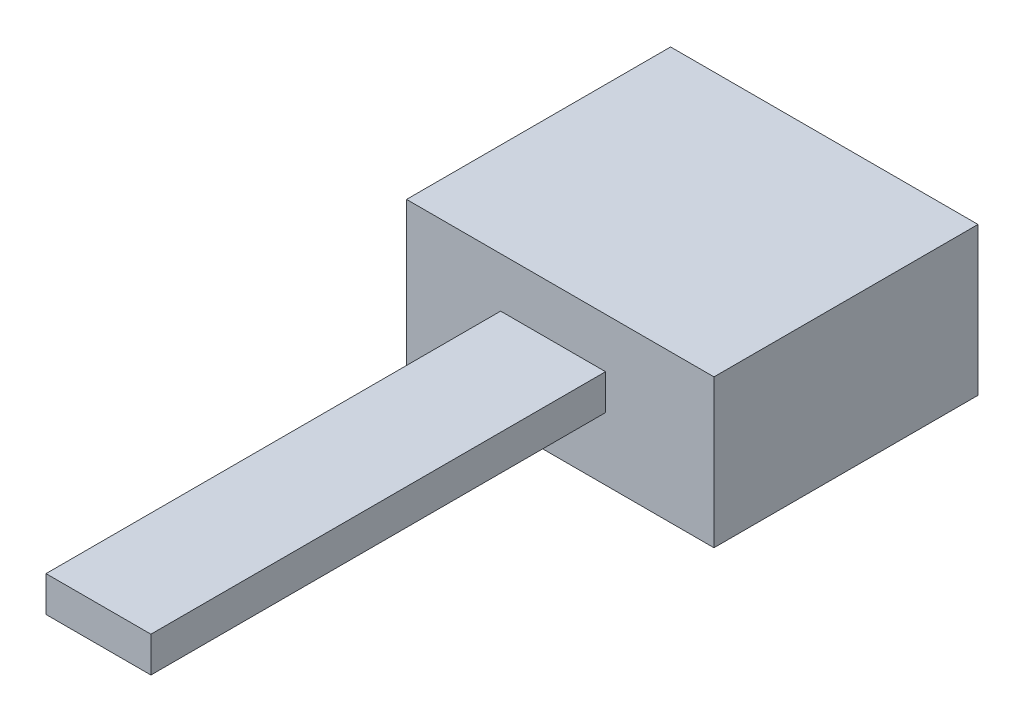
ISO-10303-21;
HEADER;
FILE_DESCRIPTION(('STEP AP214'),'2;1');
FILE_NAME('part.step','',(''),(''),'','','');
FILE_SCHEMA(('AUTOMOTIVE_DESIGN { 1 0 10303 214 1 1 1 1 }'));
ENDSEC;
DATA;
#1=APPLICATION_CONTEXT('core data for automotive mechanical design processes');
#2=APPLICATION_PROTOCOL_DEFINITION('international standard','automotive_design',2000,#1);
#3=PRODUCT_CONTEXT('',#1,'mechanical');
#4=PRODUCT('Part','Part','',(#3));
#5=PRODUCT_RELATED_PRODUCT_CATEGORY('part','',(#4));
#6=PRODUCT_DEFINITION_FORMATION('','',#4);
#7=PRODUCT_DEFINITION_CONTEXT('part definition',#1,'design');
#8=PRODUCT_DEFINITION('design','',#6,#7);
#9=PRODUCT_DEFINITION_SHAPE('','',#8);
#10=(LENGTH_UNIT() NAMED_UNIT(*) SI_UNIT(.MILLI.,.METRE.));
#11=(NAMED_UNIT(*) PLANE_ANGLE_UNIT() SI_UNIT($,.RADIAN.));
#12=(NAMED_UNIT(*) SI_UNIT($,.STERADIAN.) SOLID_ANGLE_UNIT());
#13=UNCERTAINTY_MEASURE_WITH_UNIT(LENGTH_MEASURE(1.E-05),#10,'distance_accuracy_value','');
#14=(GEOMETRIC_REPRESENTATION_CONTEXT(3) GLOBAL_UNCERTAINTY_ASSIGNED_CONTEXT((#13)) GLOBAL_UNIT_ASSIGNED_CONTEXT((#10,
#11,#12)) REPRESENTATION_CONTEXT('',''));
#15=CARTESIAN_POINT('',(0.,0.,0.));
#16=DIRECTION('',(0.,0.,1.));
#17=DIRECTION('',(1.,0.,0.));
#18=AXIS2_PLACEMENT_3D('',#15,#16,#17);
#19=CARTESIAN_POINT('',(0.,21.5,0.));
#20=DIRECTION('',(0.,0.,-1.));
#21=DIRECTION('',(-1.,0.,0.));
#22=AXIS2_PLACEMENT_3D('',#19,#20,#21);
#23=PLANE('',#22);
#24=DIRECTION('',(1.,0.,0.));
#25=VECTOR('',#24,1.);
#26=CARTESIAN_POINT('',(0.,0.,0.));
#27=LINE('',#26,#25);
#28=CARTESIAN_POINT('',(0.,0.,0.));
#29=VERTEX_POINT('',#28);
#30=CARTESIAN_POINT('',(44.6532,0.,0.));
#31=VERTEX_POINT('',#30);
#32=EDGE_CURVE('E133',#29,#31,#27,.T.);
#33=ORIENTED_EDGE('',*,*,#32,.T.);
#34=DIRECTION('',(0.,-1.,0.));
#35=VECTOR('',#34,1.);
#36=CARTESIAN_POINT('',(44.6532,21.5,0.));
#37=LINE('',#36,#35);
#38=CARTESIAN_POINT('',(44.6532,21.5,0.));
#39=VERTEX_POINT('',#38);
#40=EDGE_CURVE('E48',#39,#31,#37,.T.);
#41=ORIENTED_EDGE('',*,*,#40,.F.);
#42=DIRECTION('',(1.,0.,0.));
#43=VECTOR('',#42,1.);
#44=CARTESIAN_POINT('',(0.,21.5,0.));
#45=LINE('',#44,#43);
#46=CARTESIAN_POINT('',(0.,21.5,0.));
#47=VERTEX_POINT('',#46);
#48=EDGE_CURVE('E143',#47,#39,#45,.T.);
#49=ORIENTED_EDGE('',*,*,#48,.F.);
#50=DIRECTION('',(0.,-1.,0.));
#51=VECTOR('',#50,1.);
#52=CARTESIAN_POINT('',(0.,21.5,0.));
#53=LINE('',#52,#51);
#54=EDGE_CURVE('E11',#47,#29,#53,.T.);
#55=ORIENTED_EDGE('',*,*,#54,.T.);
#56=EDGE_LOOP('',(#33,#41,#49,#55));
#57=FACE_BOUND('',#56,.T.);
#58=DIRECTION('',(0.,-1.,0.));
#59=VECTOR('',#58,1.);
#60=CARTESIAN_POINT('',(13.6673265662921,14.2781488346486,0.));
#61=LINE('',#60,#59);
#62=CARTESIAN_POINT('',(13.6673265662921,14.2781488346486,0.));
#63=VERTEX_POINT('',#62);
#64=CARTESIAN_POINT('',(13.6673265662921,9.13606666989608,0.));
#65=VERTEX_POINT('',#64);
#66=EDGE_CURVE('E55',#63,#65,#61,.T.);
#67=ORIENTED_EDGE('',*,*,#66,.F.);
#68=DIRECTION('',(-1.,0.,0.));
#69=VECTOR('',#68,1.);
#70=CARTESIAN_POINT('',(13.6673265662921,14.2781488346486,0.));
#71=LINE('',#70,#69);
#72=CARTESIAN_POINT('',(28.9073265662921,14.2781488346486,0.));
#73=VERTEX_POINT('',#72);
#74=EDGE_CURVE('E59',#73,#63,#71,.T.);
#75=ORIENTED_EDGE('',*,*,#74,.F.);
#76=DIRECTION('',(0.,1.,0.));
#77=VECTOR('',#76,1.);
#78=CARTESIAN_POINT('',(28.9073265662921,14.2781488346486,0.));
#79=LINE('',#78,#77);
#80=CARTESIAN_POINT('',(28.9073265662921,9.13606666989608,0.));
#81=VERTEX_POINT('',#80);
#82=EDGE_CURVE('E283',#81,#73,#79,.T.);
#83=ORIENTED_EDGE('',*,*,#82,.F.);
#84=DIRECTION('',(1.,0.,0.));
#85=VECTOR('',#84,1.);
#86=CARTESIAN_POINT('',(13.6673265662921,9.13606666989608,0.));
#87=LINE('',#86,#85);
#88=EDGE_CURVE('E293',#65,#81,#87,.T.);
#89=ORIENTED_EDGE('',*,*,#88,.F.);
#90=EDGE_LOOP('',(#67,#75,#83,#89));
#91=FACE_BOUND('',#90,.T.);
#92=ADVANCED_FACE('F39',(#57,#91),#23,.F.);
#93=CARTESIAN_POINT('',(0.,21.5,0.));
#94=DIRECTION('',(1.,0.,0.));
#95=DIRECTION('',(0.,0.,-1.));
#96=AXIS2_PLACEMENT_3D('',#93,#94,#95);
#97=PLANE('',#96);
#98=DIRECTION('',(0.,0.,1.));
#99=VECTOR('',#98,1.);
#100=CARTESIAN_POINT('',(0.,0.,0.));
#101=LINE('',#100,#99);
#102=CARTESIAN_POINT('',(0.,0.,-38.354));
#103=VERTEX_POINT('',#102);
#104=EDGE_CURVE('E128',#103,#29,#101,.T.);
#105=ORIENTED_EDGE('',*,*,#104,.T.);
#106=ORIENTED_EDGE('',*,*,#54,.F.);
#107=DIRECTION('',(0.,0.,1.));
#108=VECTOR('',#107,1.);
#109=CARTESIAN_POINT('',(0.,21.5,0.));
#110=LINE('',#109,#108);
#111=CARTESIAN_POINT('',(0.,21.5,-38.354));
#112=VERTEX_POINT('',#111);
#113=EDGE_CURVE('E139',#112,#47,#110,.T.);
#114=ORIENTED_EDGE('',*,*,#113,.F.);
#115=DIRECTION('',(0.,-1.,0.));
#116=VECTOR('',#115,1.);
#117=CARTESIAN_POINT('',(0.,21.5,-38.354));
#118=LINE('',#117,#116);
#119=EDGE_CURVE('E152',#112,#103,#118,.T.);
#120=ORIENTED_EDGE('',*,*,#119,.T.);
#121=EDGE_LOOP('',(#105,#106,#114,#120));
#122=FACE_BOUND('',#121,.T.);
#123=ADVANCED_FACE('F41',(#122),#97,.F.);
#124=CARTESIAN_POINT('',(44.6532,21.5,0.));
#125=DIRECTION('',(-1.,0.,0.));
#126=DIRECTION('',(0.,0.,1.));
#127=AXIS2_PLACEMENT_3D('',#124,#125,#126);
#128=PLANE('',#127);
#129=DIRECTION('',(0.,0.,-1.));
#130=VECTOR('',#129,1.);
#131=CARTESIAN_POINT('',(44.6532,0.,0.));
#132=LINE('',#131,#130);
#133=CARTESIAN_POINT('',(44.6532,0.,-38.354));
#134=VERTEX_POINT('',#133);
#135=EDGE_CURVE('E156',#31,#134,#132,.T.);
#136=ORIENTED_EDGE('',*,*,#135,.T.);
#137=DIRECTION('',(0.,-1.,0.));
#138=VECTOR('',#137,1.);
#139=CARTESIAN_POINT('',(44.6532,21.5,-38.354));
#140=LINE('',#139,#138);
#141=CARTESIAN_POINT('',(44.6532,21.5,-38.354));
#142=VERTEX_POINT('',#141);
#143=EDGE_CURVE('E164',#142,#134,#140,.T.);
#144=ORIENTED_EDGE('',*,*,#143,.F.);
#145=DIRECTION('',(0.,0.,-1.));
#146=VECTOR('',#145,1.);
#147=CARTESIAN_POINT('',(44.6532,21.5,0.));
#148=LINE('',#147,#146);
#149=EDGE_CURVE('E147',#39,#142,#148,.T.);
#150=ORIENTED_EDGE('',*,*,#149,.F.);
#151=ORIENTED_EDGE('',*,*,#40,.T.);
#152=EDGE_LOOP('',(#136,#144,#150,#151));
#153=FACE_BOUND('',#152,.T.);
#154=ADVANCED_FACE('F173',(#153),#128,.F.);
#155=CARTESIAN_POINT('',(0.,21.5,-38.354));
#156=DIRECTION('',(0.,0.,1.));
#157=DIRECTION('',(1.,0.,0.));
#158=AXIS2_PLACEMENT_3D('',#155,#156,#157);
#159=PLANE('',#158);
#160=DIRECTION('',(-1.,0.,0.));
#161=VECTOR('',#160,1.);
#162=CARTESIAN_POINT('',(0.,0.,-38.354));
#163=LINE('',#162,#161);
#164=EDGE_CURVE('E144',#134,#103,#163,.T.);
#165=ORIENTED_EDGE('',*,*,#164,.T.);
#166=ORIENTED_EDGE('',*,*,#119,.F.);
#167=DIRECTION('',(-1.,0.,0.));
#168=VECTOR('',#167,1.);
#169=CARTESIAN_POINT('',(0.,21.5,-38.354));
#170=LINE('',#169,#168);
#171=EDGE_CURVE('E150',#142,#112,#170,.T.);
#172=ORIENTED_EDGE('',*,*,#171,.F.);
#173=ORIENTED_EDGE('',*,*,#143,.T.);
#174=EDGE_LOOP('',(#165,#166,#172,#173));
#175=FACE_BOUND('',#174,.T.);
#176=ADVANCED_FACE('F182',(#175),#159,.F.);
#177=CARTESIAN_POINT('',(0.,21.5,0.));
#178=DIRECTION('',(0.,-1.,0.));
#179=DIRECTION('',(0.,0.,-1.));
#180=AXIS2_PLACEMENT_3D('',#177,#178,#179);
#181=PLANE('',#180);
#182=ORIENTED_EDGE('',*,*,#113,.T.);
#183=ORIENTED_EDGE('',*,*,#48,.T.);
#184=ORIENTED_EDGE('',*,*,#149,.T.);
#185=ORIENTED_EDGE('',*,*,#171,.T.);
#186=EDGE_LOOP('',(#182,#183,#184,#185));
#187=FACE_BOUND('',#186,.T.);
#188=ADVANCED_FACE('F188',(#187),#181,.F.);
#189=CARTESIAN_POINT('',(0.,0.,0.));
#190=DIRECTION('',(0.,-1.,0.));
#191=DIRECTION('',(0.,0.,-1.));
#192=AXIS2_PLACEMENT_3D('',#189,#190,#191);
#193=PLANE('',#192);
#194=ORIENTED_EDGE('',*,*,#104,.F.);
#195=ORIENTED_EDGE('',*,*,#164,.F.);
#196=ORIENTED_EDGE('',*,*,#135,.F.);
#197=ORIENTED_EDGE('',*,*,#32,.F.);
#198=EDGE_LOOP('',(#194,#195,#196,#197));
#199=FACE_BOUND('',#198,.T.);
#200=ADVANCED_FACE('F179',(#199),#193,.T.);
#201=CARTESIAN_POINT('',(13.6673265662921,14.2781488346486,66.04));
#202=DIRECTION('',(1.,0.,0.));
#203=DIRECTION('',(0.,0.,-1.));
#204=AXIS2_PLACEMENT_3D('',#201,#202,#203);
#205=PLANE('',#204);
#206=ORIENTED_EDGE('',*,*,#66,.T.);
#207=DIRECTION('',(0.,0.,-1.));
#208=VECTOR('',#207,1.);
#209=CARTESIAN_POINT('',(13.6673265662921,9.13606666989608,66.04));
#210=LINE('',#209,#208);
#211=CARTESIAN_POINT('',(13.6673265662921,9.13606666989608,66.04));
#212=VERTEX_POINT('',#211);
#213=EDGE_CURVE('E108',#212,#65,#210,.T.);
#214=ORIENTED_EDGE('',*,*,#213,.F.);
#215=DIRECTION('',(0.,-1.,0.));
#216=VECTOR('',#215,1.);
#217=CARTESIAN_POINT('',(13.6673265662921,14.2781488346486,66.04));
#218=LINE('',#217,#216);
#219=CARTESIAN_POINT('',(13.6673265662921,14.2781488346486,66.04));
#220=VERTEX_POINT('',#219);
#221=EDGE_CURVE('E115',#220,#212,#218,.T.);
#222=ORIENTED_EDGE('',*,*,#221,.F.);
#223=DIRECTION('',(0.,0.,-1.));
#224=VECTOR('',#223,1.);
#225=CARTESIAN_POINT('',(13.6673265662921,14.2781488346486,66.04));
#226=LINE('',#225,#224);
#227=EDGE_CURVE('E280',#220,#63,#226,.T.);
#228=ORIENTED_EDGE('',*,*,#227,.T.);
#229=EDGE_LOOP('',(#206,#214,#222,#228));
#230=FACE_BOUND('',#229,.T.);
#231=ADVANCED_FACE('F126',(#230),#205,.F.);
#232=CARTESIAN_POINT('',(13.6673265662921,9.13606666989608,66.04));
#233=DIRECTION('',(0.,1.,0.));
#234=DIRECTION('',(0.,0.,1.));
#235=AXIS2_PLACEMENT_3D('',#232,#233,#234);
#236=PLANE('',#235);
#237=ORIENTED_EDGE('',*,*,#88,.T.);
#238=DIRECTION('',(0.,0.,-1.));
#239=VECTOR('',#238,1.);
#240=CARTESIAN_POINT('',(28.9073265662921,9.13606666989608,66.04));
#241=LINE('',#240,#239);
#242=CARTESIAN_POINT('',(28.9073265662921,9.13606666989608,66.04));
#243=VERTEX_POINT('',#242);
#244=EDGE_CURVE('E110',#243,#81,#241,.T.);
#245=ORIENTED_EDGE('',*,*,#244,.F.);
#246=DIRECTION('',(1.,0.,0.));
#247=VECTOR('',#246,1.);
#248=CARTESIAN_POINT('',(13.6673265662921,9.13606666989608,66.04));
#249=LINE('',#248,#247);
#250=EDGE_CURVE('E103',#212,#243,#249,.T.);
#251=ORIENTED_EDGE('',*,*,#250,.F.);
#252=ORIENTED_EDGE('',*,*,#213,.T.);
#253=EDGE_LOOP('',(#237,#245,#251,#252));
#254=FACE_BOUND('',#253,.T.);
#255=ADVANCED_FACE('F106',(#254),#236,.F.);
#256=CARTESIAN_POINT('',(28.9073265662921,14.2781488346486,66.04));
#257=DIRECTION('',(-1.,0.,0.));
#258=DIRECTION('',(0.,-1.,0.));
#259=AXIS2_PLACEMENT_3D('',#256,#257,#258);
#260=PLANE('',#259);
#261=ORIENTED_EDGE('',*,*,#82,.T.);
#262=DIRECTION('',(0.,0.,-1.));
#263=VECTOR('',#262,1.);
#264=CARTESIAN_POINT('',(28.9073265662921,14.2781488346486,66.04));
#265=LINE('',#264,#263);
#266=CARTESIAN_POINT('',(28.9073265662921,14.2781488346486,66.04));
#267=VERTEX_POINT('',#266);
#268=EDGE_CURVE('E135',#267,#73,#265,.T.);
#269=ORIENTED_EDGE('',*,*,#268,.F.);
#270=DIRECTION('',(0.,1.,0.));
#271=VECTOR('',#270,1.);
#272=CARTESIAN_POINT('',(28.9073265662921,14.2781488346486,66.04));
#273=LINE('',#272,#271);
#274=EDGE_CURVE('E114',#243,#267,#273,.T.);
#275=ORIENTED_EDGE('',*,*,#274,.F.);
#276=ORIENTED_EDGE('',*,*,#244,.T.);
#277=EDGE_LOOP('',(#261,#269,#275,#276));
#278=FACE_BOUND('',#277,.T.);
#279=ADVANCED_FACE('F206',(#278),#260,.F.);
#280=CARTESIAN_POINT('',(13.6673265662921,14.2781488346486,66.04));
#281=DIRECTION('',(0.,-1.,0.));
#282=DIRECTION('',(0.,0.,-1.));
#283=AXIS2_PLACEMENT_3D('',#280,#281,#282);
#284=PLANE('',#283);
#285=ORIENTED_EDGE('',*,*,#74,.T.);
#286=ORIENTED_EDGE('',*,*,#227,.F.);
#287=DIRECTION('',(-1.,0.,0.));
#288=VECTOR('',#287,1.);
#289=CARTESIAN_POINT('',(13.6673265662921,14.2781488346486,66.04));
#290=LINE('',#289,#288);
#291=EDGE_CURVE('E120',#267,#220,#290,.T.);
#292=ORIENTED_EDGE('',*,*,#291,.F.);
#293=ORIENTED_EDGE('',*,*,#268,.T.);
#294=EDGE_LOOP('',(#285,#286,#292,#293));
#295=FACE_BOUND('',#294,.T.);
#296=ADVANCED_FACE('F209',(#295),#284,.F.);
#297=CARTESIAN_POINT('',(0.,0.,66.04));
#298=DIRECTION('',(0.,0.,1.));
#299=DIRECTION('',(1.,0.,0.));
#300=AXIS2_PLACEMENT_3D('',#297,#298,#299);
#301=PLANE('',#300);
#302=ORIENTED_EDGE('',*,*,#221,.T.);
#303=ORIENTED_EDGE('',*,*,#250,.T.);
#304=ORIENTED_EDGE('',*,*,#274,.T.);
#305=ORIENTED_EDGE('',*,*,#291,.T.);
#306=EDGE_LOOP('',(#302,#303,#304,#305));
#307=FACE_BOUND('',#306,.T.);
#308=ADVANCED_FACE('F118',(#307),#301,.T.);
#309=CLOSED_SHELL('',(#92,#123,#154,#176,#188,#200,#231,#255,#279,#296,#308));
#310=MANIFOLD_SOLID_BREP('B2',#309);
#311=ADVANCED_BREP_SHAPE_REPRESENTATION('',(#18,#310),#14);
#312=SHAPE_DEFINITION_REPRESENTATION(#9,#311);
ENDSEC;
END-ISO-10303-21;
